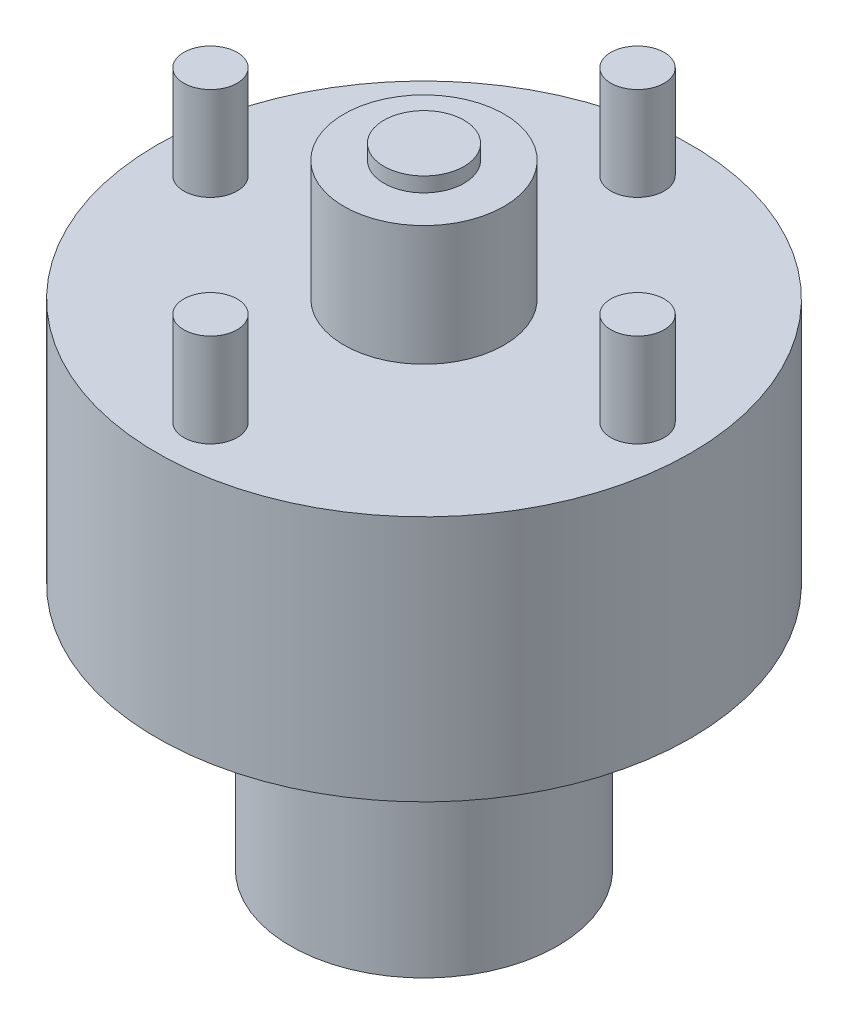
ISO-10303-21;
HEADER;
FILE_DESCRIPTION(('STEP AP214'),'2;1');
FILE_NAME('part.step','',(''),(''),'','','');
FILE_SCHEMA(('AUTOMOTIVE_DESIGN { 1 0 10303 214 1 1 1 1 }'));
ENDSEC;
DATA;
#1=APPLICATION_CONTEXT('core data for automotive mechanical design processes');
#2=APPLICATION_PROTOCOL_DEFINITION('international standard','automotive_design',2000,#1);
#3=PRODUCT_CONTEXT('',#1,'mechanical');
#4=PRODUCT('Part','Part','',(#3));
#5=PRODUCT_RELATED_PRODUCT_CATEGORY('part','',(#4));
#6=PRODUCT_DEFINITION_FORMATION('','',#4);
#7=PRODUCT_DEFINITION_CONTEXT('part definition',#1,'design');
#8=PRODUCT_DEFINITION('design','',#6,#7);
#9=PRODUCT_DEFINITION_SHAPE('','',#8);
#10=(LENGTH_UNIT() NAMED_UNIT(*) SI_UNIT(.MILLI.,.METRE.));
#11=(NAMED_UNIT(*) PLANE_ANGLE_UNIT() SI_UNIT($,.RADIAN.));
#12=(NAMED_UNIT(*) SI_UNIT($,.STERADIAN.) SOLID_ANGLE_UNIT());
#13=UNCERTAINTY_MEASURE_WITH_UNIT(LENGTH_MEASURE(1.E-05),#10,'distance_accuracy_value','');
#14=(GEOMETRIC_REPRESENTATION_CONTEXT(3) GLOBAL_UNCERTAINTY_ASSIGNED_CONTEXT((#13)) GLOBAL_UNIT_ASSIGNED_CONTEXT((#10,
#11,#12)) REPRESENTATION_CONTEXT('',''));
#15=CARTESIAN_POINT('',(0.,0.,0.));
#16=DIRECTION('',(0.,0.,1.));
#17=DIRECTION('',(1.,0.,0.));
#18=AXIS2_PLACEMENT_3D('',#15,#16,#17);
#19=CARTESIAN_POINT('',(0.,14.375,0.));
#20=DIRECTION('',(0.,1.,0.));
#21=DIRECTION('',(-1.,0.,0.));
#22=AXIS2_PLACEMENT_3D('',#19,#20,#21);
#23=PLANE('',#22);
#24=CARTESIAN_POINT('',(0.,14.375,0.));
#25=DIRECTION('',(0.,-1.,0.));
#26=DIRECTION('',(1.,0.,0.));
#27=AXIS2_PLACEMENT_3D('',#24,#25,#26);
#28=CIRCLE('',#27,1.5);
#29=CARTESIAN_POINT('',(1.5,14.375,0.));
#30=VERTEX_POINT('',#29);
#31=EDGE_CURVE('E10',#30,#30,#28,.T.);
#32=ORIENTED_EDGE('',*,*,#31,.F.);
#33=EDGE_LOOP('',(#32));
#34=FACE_BOUND('',#33,.T.);
#35=ADVANCED_FACE('F14',(#34),#23,.T.);
#36=CARTESIAN_POINT('',(0.,-4.325,0.));
#37=DIRECTION('',(0.,-1.,0.));
#38=DIRECTION('',(1.,0.,0.));
#39=AXIS2_PLACEMENT_3D('',#36,#37,#38);
#40=CYLINDRICAL_SURFACE('',#39,1.5);
#41=ORIENTED_EDGE('',*,*,#31,.T.);
#42=EDGE_LOOP('',(#41));
#43=FACE_BOUND('',#42,.T.);
#44=CARTESIAN_POINT('',(0.,13.825,0.));
#45=DIRECTION('',(0.,-1.,0.));
#46=DIRECTION('',(1.,0.,0.));
#47=AXIS2_PLACEMENT_3D('',#44,#45,#46);
#48=CIRCLE('',#47,1.5);
#49=CARTESIAN_POINT('',(1.5,13.825,0.));
#50=VERTEX_POINT('',#49);
#51=EDGE_CURVE('E26',#50,#50,#48,.T.);
#52=ORIENTED_EDGE('',*,*,#51,.F.);
#53=EDGE_LOOP('',(#52));
#54=FACE_BOUND('',#53,.T.);
#55=ADVANCED_FACE('F96',(#43,#54),#40,.T.);
#56=CARTESIAN_POINT('',(1.5,13.825,0.));
#57=DIRECTION('',(0.,1.,0.));
#58=DIRECTION('',(-1.,0.,0.));
#59=AXIS2_PLACEMENT_3D('',#56,#57,#58);
#60=PLANE('',#59);
#61=ORIENTED_EDGE('',*,*,#51,.T.);
#62=EDGE_LOOP('',(#61));
#63=FACE_BOUND('',#62,.T.);
#64=CARTESIAN_POINT('',(0.,13.825,0.));
#65=DIRECTION('',(0.,-1.,0.));
#66=DIRECTION('',(1.,0.,0.));
#67=AXIS2_PLACEMENT_3D('',#64,#65,#66);
#68=CIRCLE('',#67,3.);
#69=CARTESIAN_POINT('',(3.,13.825,0.));
#70=VERTEX_POINT('',#69);
#71=EDGE_CURVE('E30',#70,#70,#68,.T.);
#72=ORIENTED_EDGE('',*,*,#71,.F.);
#73=EDGE_LOOP('',(#72));
#74=FACE_BOUND('',#73,.T.);
#75=ADVANCED_FACE('F101',(#63,#74),#60,.T.);
#76=CARTESIAN_POINT('',(0.,-4.325,0.));
#77=DIRECTION('',(0.,-1.,0.));
#78=DIRECTION('',(1.,0.,0.));
#79=AXIS2_PLACEMENT_3D('',#76,#77,#78);
#80=CYLINDRICAL_SURFACE('',#79,3.);
#81=ORIENTED_EDGE('',*,*,#71,.T.);
#82=EDGE_LOOP('',(#81));
#83=FACE_BOUND('',#82,.T.);
#84=CARTESIAN_POINT('',(0.,9.325,0.));
#85=DIRECTION('',(0.,-1.,0.));
#86=DIRECTION('',(1.,0.,0.));
#87=AXIS2_PLACEMENT_3D('',#84,#85,#86);
#88=CIRCLE('',#87,3.);
#89=CARTESIAN_POINT('',(3.,9.325,0.));
#90=VERTEX_POINT('',#89);
#91=EDGE_CURVE('E35',#90,#90,#88,.T.);
#92=ORIENTED_EDGE('',*,*,#91,.F.);
#93=EDGE_LOOP('',(#92));
#94=FACE_BOUND('',#93,.T.);
#95=ADVANCED_FACE('F105',(#83,#94),#80,.T.);
#96=CARTESIAN_POINT('',(10.,9.325,0.));
#97=DIRECTION('',(0.,1.,0.));
#98=DIRECTION('',(-1.,0.,0.));
#99=AXIS2_PLACEMENT_3D('',#96,#97,#98);
#100=PLANE('',#99);
#101=CARTESIAN_POINT('',(8.,9.325,1.5144976769533E-13));
#102=DIRECTION('',(0.,1.,0.));
#103=DIRECTION('',(-1.,0.,0.));
#104=AXIS2_PLACEMENT_3D('',#101,#102,#103);
#105=CIRCLE('',#104,1.);
#106=CARTESIAN_POINT('',(7.,9.325,1.5144976769533E-13));
#107=VERTEX_POINT('',#106);
#108=EDGE_CURVE('E253',#107,#107,#105,.T.);
#109=ORIENTED_EDGE('',*,*,#108,.F.);
#110=EDGE_LOOP('',(#109));
#111=FACE_BOUND('',#110,.T.);
#112=CARTESIAN_POINT('',(1.21957625001815E-13,9.325,-8.));
#113=DIRECTION('',(0.,1.,0.));
#114=DIRECTION('',(-1.,0.,0.));
#115=AXIS2_PLACEMENT_3D('',#112,#113,#114);
#116=CIRCLE('',#115,1.);
#117=CARTESIAN_POINT('',(-0.999999999999878,9.325,-8.));
#118=VERTEX_POINT('',#117);
#119=EDGE_CURVE('E252',#118,#118,#116,.T.);
#120=ORIENTED_EDGE('',*,*,#119,.F.);
#121=EDGE_LOOP('',(#120));
#122=FACE_BOUND('',#121,.T.);
#123=CARTESIAN_POINT('',(-8.,9.325,0.));
#124=DIRECTION('',(0.,1.,0.));
#125=DIRECTION('',(-1.,0.,0.));
#126=AXIS2_PLACEMENT_3D('',#123,#124,#125);
#127=CIRCLE('',#126,1.);
#128=CARTESIAN_POINT('',(-9.,9.325,0.));
#129=VERTEX_POINT('',#128);
#130=EDGE_CURVE('E262',#129,#129,#127,.T.);
#131=ORIENTED_EDGE('',*,*,#130,.F.);
#132=EDGE_LOOP('',(#131));
#133=FACE_BOUND('',#132,.T.);
#134=CARTESIAN_POINT('',(0.,9.325,8.));
#135=DIRECTION('',(0.,1.,0.));
#136=DIRECTION('',(-1.,0.,0.));
#137=AXIS2_PLACEMENT_3D('',#134,#135,#136);
#138=CIRCLE('',#137,1.);
#139=CARTESIAN_POINT('',(-1.00000000000007,9.325,8.));
#140=VERTEX_POINT('',#139);
#141=EDGE_CURVE('E63',#140,#140,#138,.T.);
#142=ORIENTED_EDGE('',*,*,#141,.F.);
#143=EDGE_LOOP('',(#142));
#144=FACE_BOUND('',#143,.T.);
#145=ORIENTED_EDGE('',*,*,#91,.T.);
#146=EDGE_LOOP('',(#145));
#147=FACE_BOUND('',#146,.T.);
#148=CARTESIAN_POINT('',(0.,9.325,0.));
#149=DIRECTION('',(0.,-1.,0.));
#150=DIRECTION('',(1.,0.,0.));
#151=AXIS2_PLACEMENT_3D('',#148,#149,#150);
#152=CIRCLE('',#151,10.);
#153=CARTESIAN_POINT('',(10.,9.325,0.));
#154=VERTEX_POINT('',#153);
#155=EDGE_CURVE('E38',#154,#154,#152,.T.);
#156=ORIENTED_EDGE('',*,*,#155,.F.);
#157=EDGE_LOOP('',(#156));
#158=FACE_BOUND('',#157,.T.);
#159=ADVANCED_FACE('F112',(#111,#122,#133,#144,#147,#158),#100,.T.);
#160=CARTESIAN_POINT('',(0.,-4.325,0.));
#161=DIRECTION('',(0.,-1.,0.));
#162=DIRECTION('',(1.,0.,0.));
#163=AXIS2_PLACEMENT_3D('',#160,#161,#162);
#164=CYLINDRICAL_SURFACE('',#163,10.);
#165=ORIENTED_EDGE('',*,*,#155,.T.);
#166=EDGE_LOOP('',(#165));
#167=FACE_BOUND('',#166,.T.);
#168=CARTESIAN_POINT('',(0.,0.0749999999999987,0.));
#169=DIRECTION('',(0.,-1.,0.));
#170=DIRECTION('',(1.,0.,0.));
#171=AXIS2_PLACEMENT_3D('',#168,#169,#170);
#172=CIRCLE('',#171,10.);
#173=CARTESIAN_POINT('',(10.,0.0750000000000004,0.));
#174=VERTEX_POINT('',#173);
#175=EDGE_CURVE('E41',#174,#174,#172,.T.);
#176=ORIENTED_EDGE('',*,*,#175,.F.);
#177=EDGE_LOOP('',(#176));
#178=FACE_BOUND('',#177,.T.);
#179=ADVANCED_FACE('F116',(#167,#178),#164,.T.);
#180=CARTESIAN_POINT('',(5.,0.075,0.));
#181=DIRECTION('',(0.,-1.,0.));
#182=DIRECTION('',(1.,0.,0.));
#183=AXIS2_PLACEMENT_3D('',#180,#181,#182);
#184=PLANE('',#183);
#185=ORIENTED_EDGE('',*,*,#175,.T.);
#186=EDGE_LOOP('',(#185));
#187=FACE_BOUND('',#186,.T.);
#188=CARTESIAN_POINT('',(0.,0.075,0.));
#189=DIRECTION('',(0.,-1.,0.));
#190=DIRECTION('',(1.,0.,0.));
#191=AXIS2_PLACEMENT_3D('',#188,#189,#190);
#192=CIRCLE('',#191,5.);
#193=CARTESIAN_POINT('',(5.,0.0750000000000008,0.));
#194=VERTEX_POINT('',#193);
#195=EDGE_CURVE('E44',#194,#194,#192,.T.);
#196=ORIENTED_EDGE('',*,*,#195,.F.);
#197=EDGE_LOOP('',(#196));
#198=FACE_BOUND('',#197,.T.);
#199=ADVANCED_FACE('F92',(#187,#198),#184,.T.);
#200=CARTESIAN_POINT('',(0.,-4.325,0.));
#201=DIRECTION('',(0.,-1.,0.));
#202=DIRECTION('',(1.,0.,0.));
#203=AXIS2_PLACEMENT_3D('',#200,#201,#202);
#204=CYLINDRICAL_SURFACE('',#203,5.);
#205=CARTESIAN_POINT('',(-4.89897948556636,-6.75,-1.));
#206=CARTESIAN_POINT('',(-4.89898059043933,-6.80556437548198,-0.999997945876045));
#207=CARTESIAN_POINT('',(-4.89993508346913,-6.86115462330649,-0.995353171723656));
#208=CARTESIAN_POINT('',(-4.90364431385263,-6.97076250511841,-0.976912283588335));
#209=CARTESIAN_POINT('',(-4.90640049166332,-7.02477884463107,-0.963108847071181));
#210=CARTESIAN_POINT('',(-4.91338873700355,-7.12963730336293,-0.926795782617738));
#211=CARTESIAN_POINT('',(-4.91761933615312,-7.18048252153493,-0.904294814152084));
#212=CARTESIAN_POINT('',(-4.92707799486421,-7.27767484469461,-0.851249107671044));
#213=CARTESIAN_POINT('',(-4.93230599875014,-7.32402220053727,-0.820704818601296));
#214=CARTESIAN_POINT('',(-4.9432529969268,-7.4115610038545,-0.75197907565329));
#215=CARTESIAN_POINT('',(-4.94897737836825,-7.45267958788414,-0.713705655913281));
#216=CARTESIAN_POINT('',(-4.9602247230302,-7.52795753357881,-0.630806789021351));
#217=CARTESIAN_POINT('',(-4.96574767210945,-7.56211640741714,-0.586180896977995));
#218=CARTESIAN_POINT('',(-4.97602796417447,-7.6227880176285,-0.491361355924245));
#219=CARTESIAN_POINT('',(-4.9807782144152,-7.64923151381665,-0.441122567672208));
#220=CARTESIAN_POINT('',(-4.98891736883662,-7.69327493704813,-0.336804150387275));
#221=CARTESIAN_POINT('',(-4.99230640044128,-7.71087569190099,-0.282724881420554));
#222=CARTESIAN_POINT('',(-4.99730320688411,-7.73650719361963,-0.173016773278494));
#223=CARTESIAN_POINT('',(-4.99893386288125,-7.74466097757101,-0.117417739214814));
#224=CARTESIAN_POINT('',(-5.00030921183606,-7.75155095183831,-0.00561856843753665));
#225=CARTESIAN_POINT('',(-5.00005408652759,-7.75028804964582,0.0505815098318431));
#226=CARTESIAN_POINT('',(-4.99770434868515,-7.73847381978444,0.161142000743589));
#227=CARTESIAN_POINT('',(-4.99563598365838,-7.72805502283215,0.21551721429847));
#228=CARTESIAN_POINT('',(-4.98992177159409,-7.69843496754111,0.321731626580302));
#229=CARTESIAN_POINT('',(-4.98627586144039,-7.67923335780813,0.37357072374713));
#230=CARTESIAN_POINT('',(-4.97777296019959,-7.63246995985273,0.473619463200887));
#231=CARTESIAN_POINT('',(-4.97290848175224,-7.60485624889511,0.521804174133899));
#232=CARTESIAN_POINT('',(-4.96250469473785,-7.5420909227634,0.612905045859755));
#233=CARTESIAN_POINT('',(-4.95696530855222,-7.50693844022948,0.655820599525));
#234=CARTESIAN_POINT('',(-4.9457096436446,-7.42936637789153,0.735951431053457));
#235=CARTESIAN_POINT('',(-4.93999196457516,-7.38683081327041,0.773054316573631));
#236=CARTESIAN_POINT('',(-4.92911571598761,-7.29608355754925,0.839618493176807));
#237=CARTESIAN_POINT('',(-4.92395715704548,-7.2478717591168,0.869079639727751));
#238=CARTESIAN_POINT('',(-4.91478047472924,-7.1469791681782,0.919562814801881));
#239=CARTESIAN_POINT('',(-4.91076481563549,-7.09428903236034,0.940566647777709));
#240=CARTESIAN_POINT('',(-4.90436476321273,-6.98602867627601,0.973390341627581));
#241=CARTESIAN_POINT('',(-4.90198015728428,-6.93045883238092,0.985211399456641));
#242=CARTESIAN_POINT('',(-4.89915479267828,-6.81903514200096,0.999166006036051));
#243=CARTESIAN_POINT('',(-4.89868147057154,-6.76320242568966,1.00146185889791));
#244=CARTESIAN_POINT('',(-4.89964485688854,-6.65195177680032,0.996737628310738));
#245=CARTESIAN_POINT('',(-4.90108145700388,-6.59653382088114,0.989718073122442));
#246=CARTESIAN_POINT('',(-4.90567232494915,-6.48823135970776,0.966702208074156));
#247=CARTESIAN_POINT('',(-4.90880999014497,-6.43532765696424,0.950792620839297));
#248=CARTESIAN_POINT('',(-4.91643489351665,-6.33293672097126,0.910541035308517));
#249=CARTESIAN_POINT('',(-4.92092224286269,-6.28344976956428,0.886198342373176));
#250=CARTESIAN_POINT('',(-4.93081405962039,-6.18858689004984,0.829404142215597));
#251=CARTESIAN_POINT('',(-4.93622971864903,-6.14327295369917,0.796851077982752));
#252=CARTESIAN_POINT('',(-4.94733723826636,-6.05869168799908,0.724695572212711));
#253=CARTESIAN_POINT('',(-4.95302912723818,-6.01942498175074,0.685092405144536));
#254=CARTESIAN_POINT('',(-4.96415345869215,-5.94743744081442,0.59923227349789));
#255=CARTESIAN_POINT('',(-4.96958057708684,-5.91482634535,0.55288249892963));
#256=CARTESIAN_POINT('',(-4.9794712762862,-5.85785411850042,0.455267896634755));
#257=CARTESIAN_POINT('',(-4.98393489755211,-5.83349264065522,0.404003275433506));
#258=CARTESIAN_POINT('',(-4.99137294061067,-5.79387112825337,0.298302680824011));
#259=CARTESIAN_POINT('',(-4.99435579142604,-5.77855948177375,0.243886673478076));
#260=CARTESIAN_POINT('',(-4.9985323593766,-5.75730875233615,0.13318945467991));
#261=CARTESIAN_POINT('',(-4.99972629199843,-5.75136854052431,0.0769084687112125));
#262=CARTESIAN_POINT('',(-5.00018540454121,-5.74907301903711,-0.0348728939036245));
#263=CARTESIAN_POINT('',(-4.99948378549351,-5.75255271954379,-0.0903698121415032));
#264=CARTESIAN_POINT('',(-4.99630043560318,-5.76863395054781,-0.199971031315642));
#265=CARTESIAN_POINT('',(-4.99381872714351,-5.78123536634807,-0.254075349753692));
#266=CARTESIAN_POINT('',(-4.98735498365,-5.81512899209164,-0.359252749745098));
#267=CARTESIAN_POINT('',(-4.98337637247912,-5.83640137813118,-0.410332443240283));
#268=CARTESIAN_POINT('',(-4.97434722123382,-5.8870122413309,-0.508221220185954));
#269=CARTESIAN_POINT('',(-4.96929659645878,-5.91635135590372,-0.555029965767412));
#270=CARTESIAN_POINT('',(-4.95857599157868,-5.98281938706208,-0.643863890106359));
#271=CARTESIAN_POINT('',(-4.95289733422142,-6.02006633638677,-0.685799716116506));
#272=CARTESIAN_POINT('',(-4.94161222903622,-6.10105024009578,-0.762882617756848));
#273=CARTESIAN_POINT('',(-4.93600579862875,-6.14478872946874,-0.798028083202714));
#274=CARTESIAN_POINT('',(-4.92543342749964,-6.23807931670018,-0.860892219455201));
#275=CARTESIAN_POINT('',(-4.92047503631328,-6.28768896116037,-0.888526814639769));
#276=CARTESIAN_POINT('',(-4.91185237184445,-6.3909327732997,-0.93502404928781));
#277=CARTESIAN_POINT('',(-4.90818692536957,-6.44456323869792,-0.953894645979291));
#278=CARTESIAN_POINT('',(-4.90329681128922,-6.54026245543657,-0.978669139854273));
#279=CARTESIAN_POINT('',(-4.90168784915661,-6.58178541951146,-0.986653898522986));
#280=CARTESIAN_POINT('',(-4.8995287845803,-6.66553395455364,-0.99732001796041));
#281=CARTESIAN_POINT('',(-4.89897864563277,-6.70775950124817,-1.00000156156205));
#282=CARTESIAN_POINT('',(-4.89897948556636,-6.75,-1.));
#283=B_SPLINE_CURVE_WITH_KNOTS('',3,(#205,#206,#207,#208,#209,#210,#211,#212,#213,#214,#215,
#216,#217,#218,#219,#220,#221,#222,#223,#224,#225,#226,#227,#228,#229,#230,#231,#232,#233,#234,
#235,#236,#237,#238,#239,#240,#241,#242,#243,#244,#245,#246,#247,#248,#249,#250,#251,#252,#253,
#254,#255,#256,#257,#258,#259,#260,#261,#262,#263,#264,#265,#266,#267,#268,#269,#270,#271,#272,
#273,#274,#275,#276,#277,#278,#279,#280,#281,#282),.UNSPECIFIED.,.T.,.F.,(4,2,2,2,2,2,2,2,2,2,2,
2,2,2,2,2,2,2,2,2,2,2,2,2,2,2,2,2,2,2,2,2,2,2,2,2,2,2,4),(0.,0.166538463856524,
0.333210239259265,0.499716497915551,0.666213464834828,0.834822525459333,1.00344340032919,
1.17353400434947,1.34360868244057,1.51144248880577,1.67926012113745,1.84468789631034,
2.01012229071247,2.176599242198,2.34309535767563,2.5124934675998,2.68189478120217,
2.85165863170273,3.02140035013521,3.1882375780209,3.35506534525918,3.52029341780816,
3.68553510351896,3.85293059772018,4.02034332867706,4.19032601730947,4.36030156627602,
4.52929813576147,4.69827434689125,4.86431017412183,5.03034391364254,5.19600017072949,
5.36166952132181,5.53001152023094,5.69839338887278,5.86858898576538,6.0386297508643,
6.16523803634393,6.29184195681711),.UNSPECIFIED.);
#284=CARTESIAN_POINT('',(-4.89897948556636,-6.75,-1.));
#285=VERTEX_POINT('',#284);
#286=EDGE_CURVE('E56',#285,#285,#283,.T.);
#287=ORIENTED_EDGE('',*,*,#286,.F.);
#288=EDGE_LOOP('',(#287));
#289=FACE_BOUND('',#288,.T.);
#290=ORIENTED_EDGE('',*,*,#195,.T.);
#291=EDGE_LOOP('',(#290));
#292=FACE_BOUND('',#291,.T.);
#293=CARTESIAN_POINT('',(0.,-9.175,0.));
#294=DIRECTION('',(0.,-1.,0.));
#295=DIRECTION('',(1.,0.,0.));
#296=AXIS2_PLACEMENT_3D('',#293,#294,#295);
#297=CIRCLE('',#296,5.);
#298=CARTESIAN_POINT('',(5.,-9.175,0.));
#299=VERTEX_POINT('',#298);
#300=EDGE_CURVE('E47',#299,#299,#297,.T.);
#301=ORIENTED_EDGE('',*,*,#300,.F.);
#302=EDGE_LOOP('',(#301));
#303=FACE_BOUND('',#302,.T.);
#304=ADVANCED_FACE('F65',(#289,#292,#303),#204,.T.);
#305=CARTESIAN_POINT('',(2.85,-9.175,0.));
#306=DIRECTION('',(0.,-1.,0.));
#307=DIRECTION('',(1.,0.,0.));
#308=AXIS2_PLACEMENT_3D('',#305,#306,#307);
#309=PLANE('',#308);
#310=ORIENTED_EDGE('',*,*,#300,.T.);
#311=EDGE_LOOP('',(#310));
#312=FACE_BOUND('',#311,.T.);
#313=CARTESIAN_POINT('',(0.,-9.175,0.));
#314=DIRECTION('',(0.,-1.,0.));
#315=DIRECTION('',(1.,0.,0.));
#316=AXIS2_PLACEMENT_3D('',#313,#314,#315);
#317=CIRCLE('',#316,2.85);
#318=CARTESIAN_POINT('',(2.85,-9.175,0.));
#319=VERTEX_POINT('',#318);
#320=EDGE_CURVE('E50',#319,#319,#317,.T.);
#321=ORIENTED_EDGE('',*,*,#320,.F.);
#322=EDGE_LOOP('',(#321));
#323=FACE_BOUND('',#322,.T.);
#324=ADVANCED_FACE('F84',(#312,#323),#309,.T.);
#325=CARTESIAN_POINT('',(0.,-4.325,0.));
#326=DIRECTION('',(0.,-1.,0.));
#327=DIRECTION('',(1.,0.,0.));
#328=AXIS2_PLACEMENT_3D('',#325,#326,#327);
#329=CYLINDRICAL_SURFACE('',#328,2.85);
#330=CARTESIAN_POINT('',(-2.66880122901651,-6.75,-1.));
#331=CARTESIAN_POINT('',(-2.6688004561792,-6.6957195715336,-1.0000009088373));
#332=CARTESIAN_POINT('',(-2.67047529533561,-6.64144547181646,-0.995565595803335));
#333=CARTESIAN_POINT('',(-2.6769540281088,-6.53451694904152,-0.978009750469148));
#334=CARTESIAN_POINT('',(-2.68175816860933,-6.48186265412019,-0.964888532900042));
#335=CARTESIAN_POINT('',(-2.69388577441423,-6.37974264644938,-0.930488003285745));
#336=CARTESIAN_POINT('',(-2.70120386046258,-6.3302703910639,-0.909226099368961));
#337=CARTESIAN_POINT('',(-2.71752663239187,-6.23557750375952,-0.859208192677543));
#338=CARTESIAN_POINT('',(-2.72653174981666,-6.19035796414372,-0.830450271677981));
#339=CARTESIAN_POINT('',(-2.74565220206296,-6.10349109822925,-0.764919380662244));
#340=CARTESIAN_POINT('',(-2.75579731605631,-6.06205499571135,-0.727875033606545));
#341=CARTESIAN_POINT('',(-2.77580433788903,-5.98583727451353,-0.647400626530004));
#342=CARTESIAN_POINT('',(-2.78566619422497,-5.95105685957762,-0.603969413891318));
#343=CARTESIAN_POINT('',(-2.80434404816319,-5.88815556112437,-0.510385631744187));
#344=CARTESIAN_POINT('',(-2.81312099064914,-5.86025936669437,-0.460073552891832));
#345=CARTESIAN_POINT('',(-2.82828636345265,-5.81341182048635,-0.355109291057522));
#346=CARTESIAN_POINT('',(-2.83467551181298,-5.79445777922845,-0.300458418814162));
#347=CARTESIAN_POINT('',(-2.84413430705331,-5.76675879210415,-0.190585056556345));
#348=CARTESIAN_POINT('',(-2.8473215150007,-5.75765127156761,-0.135464284268941));
#349=CARTESIAN_POINT('',(-2.85043649550697,-5.74874737773224,-0.0243908239584998));
#350=CARTESIAN_POINT('',(-2.85036519708511,-5.74894835052763,0.0315616224015104));
#351=CARTESIAN_POINT('',(-2.84704888494739,-5.75843341298816,0.140130655832481));
#352=CARTESIAN_POINT('',(-2.84394173969892,-5.76732293135015,0.192786631831926));
#353=CARTESIAN_POINT('',(-2.83507910339868,-5.79327568266814,0.295805492712652));
#354=CARTESIAN_POINT('',(-2.82932342862927,-5.81033948264387,0.346168218254199));
#355=CARTESIAN_POINT('',(-2.81564310780338,-5.8523670644065,0.443992098179209));
#356=CARTESIAN_POINT('',(-2.80768960652686,-5.87743668848086,0.491403578107379));
#357=CARTESIAN_POINT('',(-2.79043223607277,-5.93467464112633,0.581457940211361));
#358=CARTESIAN_POINT('',(-2.7811279647844,-5.96684508503011,0.624099395682192));
#359=CARTESIAN_POINT('',(-2.7615721871171,-6.03932497584303,0.705742571770237));
#360=CARTESIAN_POINT('',(-2.7512965796386,-6.07996972656193,0.744441295827144));
#361=CARTESIAN_POINT('',(-2.73135409710691,-6.16724998858519,0.814578126149172));
#362=CARTESIAN_POINT('',(-2.72168733842612,-6.21388664000509,0.846014847435269));
#363=CARTESIAN_POINT('',(-2.70391670225723,-6.31288176839945,0.901217580263694));
#364=CARTESIAN_POINT('',(-2.69584274091759,-6.36532524289232,0.924841548429458));
#365=CARTESIAN_POINT('',(-2.68251690935625,-6.47380221034754,0.962815062382638));
#366=CARTESIAN_POINT('',(-2.67726370141958,-6.52983398745576,0.977169005045741));
#367=CARTESIAN_POINT('',(-2.67048203571561,-6.64093606300953,0.995548843444258));
#368=CARTESIAN_POINT('',(-2.66878256966579,-6.69591736983434,1.00004943047604));
#369=CARTESIAN_POINT('',(-2.66882018555498,-6.80586404307055,0.999949776312317));
#370=CARTESIAN_POINT('',(-2.67055655347963,-6.86082941042028,0.995351426003273));
#371=CARTESIAN_POINT('',(-2.67709835294654,-6.96691601797957,0.977612700439236));
#372=CARTESIAN_POINT('',(-2.68177988166501,-7.01810334682837,0.964816814318967));
#373=CARTESIAN_POINT('',(-2.69354382706731,-7.11758916654746,0.931467718376879));
#374=CARTESIAN_POINT('',(-2.70062669740521,-7.16588710953409,0.91091304270516));
#375=CARTESIAN_POINT('',(-2.71669459662099,-7.26005708546383,0.861833575393774));
#376=CARTESIAN_POINT('',(-2.72573641769984,-7.30578956896414,0.833060141845878));
#377=CARTESIAN_POINT('',(-2.74459943317989,-7.39194759906375,0.768634484936977));
#378=CARTESIAN_POINT('',(-2.75442088011829,-7.43237141472647,0.732980027271063));
#379=CARTESIAN_POINT('',(-2.77438046801183,-7.50903358625576,0.653511944888941));
#380=CARTESIAN_POINT('',(-2.7845069051104,-7.54492614721994,0.60936073688974));
#381=CARTESIAN_POINT('',(-2.80341637092162,-7.6088230897007,0.51541188966285));
#382=CARTESIAN_POINT('',(-2.81219942982493,-7.63682764850163,0.465614377372212));
#383=CARTESIAN_POINT('',(-2.82740339743662,-7.68391946329594,0.361960436343255));
#384=CARTESIAN_POINT('',(-2.83383726161722,-7.70305578886157,0.308128305035709));
#385=CARTESIAN_POINT('',(-2.84367108199614,-7.73191216670186,0.197736314625076));
#386=CARTESIAN_POINT('',(-2.84707226607693,-7.74163603006485,0.141177569269197));
#387=CARTESIAN_POINT('',(-2.85035502229535,-7.75101995667176,0.0300845842132699));
#388=CARTESIAN_POINT('',(-2.85040939729414,-7.75117412716316,-0.0244032316871605));
#389=CARTESIAN_POINT('',(-2.8474281140692,-7.74265442761021,-0.132592609972267));
#390=CARTESIAN_POINT('',(-2.84439275373857,-7.73398140862874,-0.186294247649049));
#391=CARTESIAN_POINT('',(-2.83564322909889,-7.70839056721116,-0.290352498452024));
#392=CARTESIAN_POINT('',(-2.82998153536733,-7.69163399239515,-0.340753502067569));
#393=CARTESIAN_POINT('',(-2.81656401936877,-7.65050517199252,-0.438042555692486));
#394=CARTESIAN_POINT('',(-2.80880780739049,-7.62613150901861,-0.48492994987479));
#395=CARTESIAN_POINT('',(-2.79161197017162,-7.56936330613099,-0.575872393051686));
#396=CARTESIAN_POINT('',(-2.78211818998541,-7.53669132596236,-0.619743858208922));
#397=CARTESIAN_POINT('',(-2.76262794495338,-7.46471125159769,-0.701539722736158));
#398=CARTESIAN_POINT('',(-2.75263131202982,-7.42540092805744,-0.739462115958666));
#399=CARTESIAN_POINT('',(-2.73272441983475,-7.33916641684199,-0.810013679639654));
#400=CARTESIAN_POINT('',(-2.7228379392885,-7.29198067097468,-0.842330970110305));
#401=CARTESIAN_POINT('',(-2.70480170290923,-7.19253549775383,-0.898567623674657));
#402=CARTESIAN_POINT('',(-2.69665173524843,-7.14027669036888,-0.922488011291749));
#403=CARTESIAN_POINT('',(-2.68319573762921,-7.03259712792493,-0.9609240878375));
#404=CARTESIAN_POINT('',(-2.67786414119202,-6.97721002696421,-0.9755245817351));
#405=CARTESIAN_POINT('',(-2.67066808381094,-6.86454568729343,-0.995059858128937));
#406=CARTESIAN_POINT('',(-2.66880204440925,-6.8072693211919,-0.999999041118564));
#407=CARTESIAN_POINT('',(-2.66880122901651,-6.75,-1.));
#408=B_SPLINE_CURVE_WITH_KNOTS('',3,(#330,#331,#332,#333,#334,#335,#336,#337,#338,#339,#340,
#341,#342,#343,#344,#345,#346,#347,#348,#349,#350,#351,#352,#353,#354,#355,#356,#357,#358,#359,
#360,#361,#362,#363,#364,#365,#366,#367,#368,#369,#370,#371,#372,#373,#374,#375,#376,#377,#378,
#379,#380,#381,#382,#383,#384,#385,#386,#387,#388,#389,#390,#391,#392,#393,#394,#395,#396,#397,
#398,#399,#400,#401,#402,#403,#404,#405,#406,#407),.UNSPECIFIED.,.T.,.F.,(4,2,2,2,2,2,2,2,2,2,2,
2,2,2,2,2,2,2,2,2,2,2,2,2,2,2,2,2,2,2,2,2,2,2,2,2,2,2,4),(0.,0.162628723538886,
0.325270279096272,0.487565965379972,0.649903223845956,0.818642974618485,0.987413214786567,
1.16112272087991,1.33477994800647,1.50179859816922,1.66876963063309,1.82849438656856,
1.98823022362496,2.15017196700624,2.31216201806398,2.4825439787521,2.65295840720246,
2.82631967049563,2.99959864611489,3.16432708021973,3.32902128504687,3.48721183361133,
3.64543228371552,3.8090664165867,3.97275377199375,4.1453166569414,4.31787566319584,
4.48946812040895,4.66099107105911,4.82365007974097,4.98629340733533,5.14581872013117,
5.30537373508047,5.47119572562199,5.63707351504663,5.81035649891892,5.98361833282314,
6.15528023611822,6.32686393334608),.UNSPECIFIED.);
#409=CARTESIAN_POINT('',(-2.66880122901651,-6.75,-1.));
#410=VERTEX_POINT('',#409);
#411=EDGE_CURVE('E17',#410,#410,#408,.T.);
#412=ORIENTED_EDGE('',*,*,#411,.F.);
#413=EDGE_LOOP('',(#412));
#414=FACE_BOUND('',#413,.T.);
#415=ORIENTED_EDGE('',*,*,#320,.T.);
#416=EDGE_LOOP('',(#415));
#417=FACE_BOUND('',#416,.T.);
#418=CARTESIAN_POINT('',(0.,-4.325,0.));
#419=DIRECTION('',(0.,-1.,0.));
#420=DIRECTION('',(1.,0.,0.));
#421=AXIS2_PLACEMENT_3D('',#418,#419,#420);
#422=CIRCLE('',#421,2.85);
#423=CARTESIAN_POINT('',(2.85,-4.325,0.));
#424=VERTEX_POINT('',#423);
#425=EDGE_CURVE('E53',#424,#424,#422,.T.);
#426=ORIENTED_EDGE('',*,*,#425,.F.);
#427=EDGE_LOOP('',(#426));
#428=FACE_BOUND('',#427,.T.);
#429=ADVANCED_FACE('F80',(#414,#417,#428),#329,.F.);
#430=CARTESIAN_POINT('',(2.85,-4.325,0.));
#431=DIRECTION('',(0.,-1.,0.));
#432=DIRECTION('',(1.,0.,0.));
#433=AXIS2_PLACEMENT_3D('',#430,#431,#432);
#434=PLANE('',#433);
#435=ORIENTED_EDGE('',*,*,#425,.T.);
#436=EDGE_LOOP('',(#435));
#437=FACE_BOUND('',#436,.T.);
#438=ADVANCED_FACE('F75',(#437),#434,.T.);
#439=CARTESIAN_POINT('',(-11.,-6.75,0.));
#440=DIRECTION('',(1.,0.,0.));
#441=DIRECTION('',(0.,0.,-1.));
#442=AXIS2_PLACEMENT_3D('',#439,#440,#441);
#443=CYLINDRICAL_SURFACE('',#442,1.);
#444=ORIENTED_EDGE('',*,*,#286,.T.);
#445=EDGE_LOOP('',(#444));
#446=FACE_BOUND('',#445,.T.);
#447=ORIENTED_EDGE('',*,*,#411,.T.);
#448=EDGE_LOOP('',(#447));
#449=FACE_BOUND('',#448,.T.);
#450=ADVANCED_FACE('F69',(#446,#449),#443,.F.);
#451=CARTESIAN_POINT('',(0.,12.825,8.));
#452=DIRECTION('',(0.,-1.,0.));
#453=DIRECTION('',(1.,0.,0.));
#454=AXIS2_PLACEMENT_3D('',#451,#452,#453);
#455=CYLINDRICAL_SURFACE('',#454,1.);
#456=CARTESIAN_POINT('',(0.,12.825,8.));
#457=DIRECTION('',(0.,1.,0.));
#458=DIRECTION('',(-1.,0.,0.));
#459=AXIS2_PLACEMENT_3D('',#456,#457,#458);
#460=CIRCLE('',#459,1.);
#461=CARTESIAN_POINT('',(-1.00000000000007,12.825,8.));
#462=VERTEX_POINT('',#461);
#463=EDGE_CURVE('E268',#462,#462,#460,.T.);
#464=ORIENTED_EDGE('',*,*,#463,.F.);
#465=EDGE_LOOP('',(#464));
#466=FACE_BOUND('',#465,.T.);
#467=ORIENTED_EDGE('',*,*,#141,.T.);
#468=EDGE_LOOP('',(#467));
#469=FACE_BOUND('',#468,.T.);
#470=ADVANCED_FACE('F74',(#466,#469),#455,.T.);
#471=CARTESIAN_POINT('',(0.,12.825,8.));
#472=DIRECTION('',(0.,1.,0.));
#473=DIRECTION('',(-1.,0.,0.));
#474=AXIS2_PLACEMENT_3D('',#471,#472,#473);
#475=PLANE('',#474);
#476=ORIENTED_EDGE('',*,*,#463,.T.);
#477=EDGE_LOOP('',(#476));
#478=FACE_BOUND('',#477,.T.);
#479=ADVANCED_FACE('F176',(#478),#475,.T.);
#480=CARTESIAN_POINT('',(-8.,12.825,0.));
#481=DIRECTION('',(0.,-1.,0.));
#482=DIRECTION('',(1.,0.,0.));
#483=AXIS2_PLACEMENT_3D('',#480,#481,#482);
#484=CYLINDRICAL_SURFACE('',#483,1.);
#485=CARTESIAN_POINT('',(-8.,12.825,0.));
#486=DIRECTION('',(0.,1.,0.));
#487=DIRECTION('',(-1.,0.,0.));
#488=AXIS2_PLACEMENT_3D('',#485,#486,#487);
#489=CIRCLE('',#488,1.);
#490=CARTESIAN_POINT('',(-9.,12.825,0.));
#491=VERTEX_POINT('',#490);
#492=EDGE_CURVE('E264',#491,#491,#489,.T.);
#493=ORIENTED_EDGE('',*,*,#492,.F.);
#494=EDGE_LOOP('',(#493));
#495=FACE_BOUND('',#494,.T.);
#496=ORIENTED_EDGE('',*,*,#130,.T.);
#497=EDGE_LOOP('',(#496));
#498=FACE_BOUND('',#497,.T.);
#499=ADVANCED_FACE('F185',(#495,#498),#484,.T.);
#500=CARTESIAN_POINT('',(-8.,12.825,0.));
#501=DIRECTION('',(0.,1.,0.));
#502=DIRECTION('',(-1.,0.,0.));
#503=AXIS2_PLACEMENT_3D('',#500,#501,#502);
#504=PLANE('',#503);
#505=ORIENTED_EDGE('',*,*,#492,.T.);
#506=EDGE_LOOP('',(#505));
#507=FACE_BOUND('',#506,.T.);
#508=ADVANCED_FACE('F194',(#507),#504,.T.);
#509=CARTESIAN_POINT('',(1.21528998622113E-13,12.825,-8.));
#510=DIRECTION('',(0.,-1.,0.));
#511=DIRECTION('',(1.,0.,0.));
#512=AXIS2_PLACEMENT_3D('',#509,#510,#511);
#513=CYLINDRICAL_SURFACE('',#512,1.);
#514=CARTESIAN_POINT('',(1.21528998622113E-13,12.825,-8.));
#515=DIRECTION('',(0.,1.,0.));
#516=DIRECTION('',(-1.,0.,0.));
#517=AXIS2_PLACEMENT_3D('',#514,#515,#516);
#518=CIRCLE('',#517,1.);
#519=CARTESIAN_POINT('',(-0.999999999999879,12.825,-8.));
#520=VERTEX_POINT('',#519);
#521=EDGE_CURVE('E256',#520,#520,#518,.T.);
#522=ORIENTED_EDGE('',*,*,#521,.F.);
#523=EDGE_LOOP('',(#522));
#524=FACE_BOUND('',#523,.T.);
#525=ORIENTED_EDGE('',*,*,#119,.T.);
#526=EDGE_LOOP('',(#525));
#527=FACE_BOUND('',#526,.T.);
#528=ADVANCED_FACE('F204',(#524,#527),#513,.T.);
#529=CARTESIAN_POINT('',(1.21528998622113E-13,12.825,-8.));
#530=DIRECTION('',(0.,1.,0.));
#531=DIRECTION('',(-1.,0.,0.));
#532=AXIS2_PLACEMENT_3D('',#529,#530,#531);
#533=PLANE('',#532);
#534=ORIENTED_EDGE('',*,*,#521,.T.);
#535=EDGE_LOOP('',(#534));
#536=FACE_BOUND('',#535,.T.);
#537=ADVANCED_FACE('F214',(#536),#533,.T.);
#538=CARTESIAN_POINT('',(8.,12.825,1.5144976769533E-13));
#539=DIRECTION('',(0.,-1.,0.));
#540=DIRECTION('',(1.,0.,0.));
#541=AXIS2_PLACEMENT_3D('',#538,#539,#540);
#542=CYLINDRICAL_SURFACE('',#541,1.);
#543=CARTESIAN_POINT('',(8.,12.825,1.5144976769533E-13));
#544=DIRECTION('',(0.,1.,0.));
#545=DIRECTION('',(-1.,0.,0.));
#546=AXIS2_PLACEMENT_3D('',#543,#544,#545);
#547=CIRCLE('',#546,1.);
#548=CARTESIAN_POINT('',(7.,12.825,1.5144976769533E-13));
#549=VERTEX_POINT('',#548);
#550=EDGE_CURVE('E251',#549,#549,#547,.T.);
#551=ORIENTED_EDGE('',*,*,#550,.F.);
#552=EDGE_LOOP('',(#551));
#553=FACE_BOUND('',#552,.T.);
#554=ORIENTED_EDGE('',*,*,#108,.T.);
#555=EDGE_LOOP('',(#554));
#556=FACE_BOUND('',#555,.T.);
#557=ADVANCED_FACE('F224',(#553,#556),#542,.T.);
#558=CARTESIAN_POINT('',(8.,12.825,1.5144976769533E-13));
#559=DIRECTION('',(0.,1.,0.));
#560=DIRECTION('',(-1.,0.,0.));
#561=AXIS2_PLACEMENT_3D('',#558,#559,#560);
#562=PLANE('',#561);
#563=ORIENTED_EDGE('',*,*,#550,.T.);
#564=EDGE_LOOP('',(#563));
#565=FACE_BOUND('',#564,.T.);
#566=ADVANCED_FACE('F234',(#565),#562,.T.);
#567=CLOSED_SHELL('',(#35,#55,#75,#95,#159,#179,#199,#304,#324,#429,#438,#450,#470,#479,#499,
#508,#528,#537,#557,#566));
#568=MANIFOLD_SOLID_BREP('B1',#567);
#569=ADVANCED_BREP_SHAPE_REPRESENTATION('',(#18,#568),#14);
#570=SHAPE_DEFINITION_REPRESENTATION(#9,#569);
ENDSEC;
END-ISO-10303-21;
